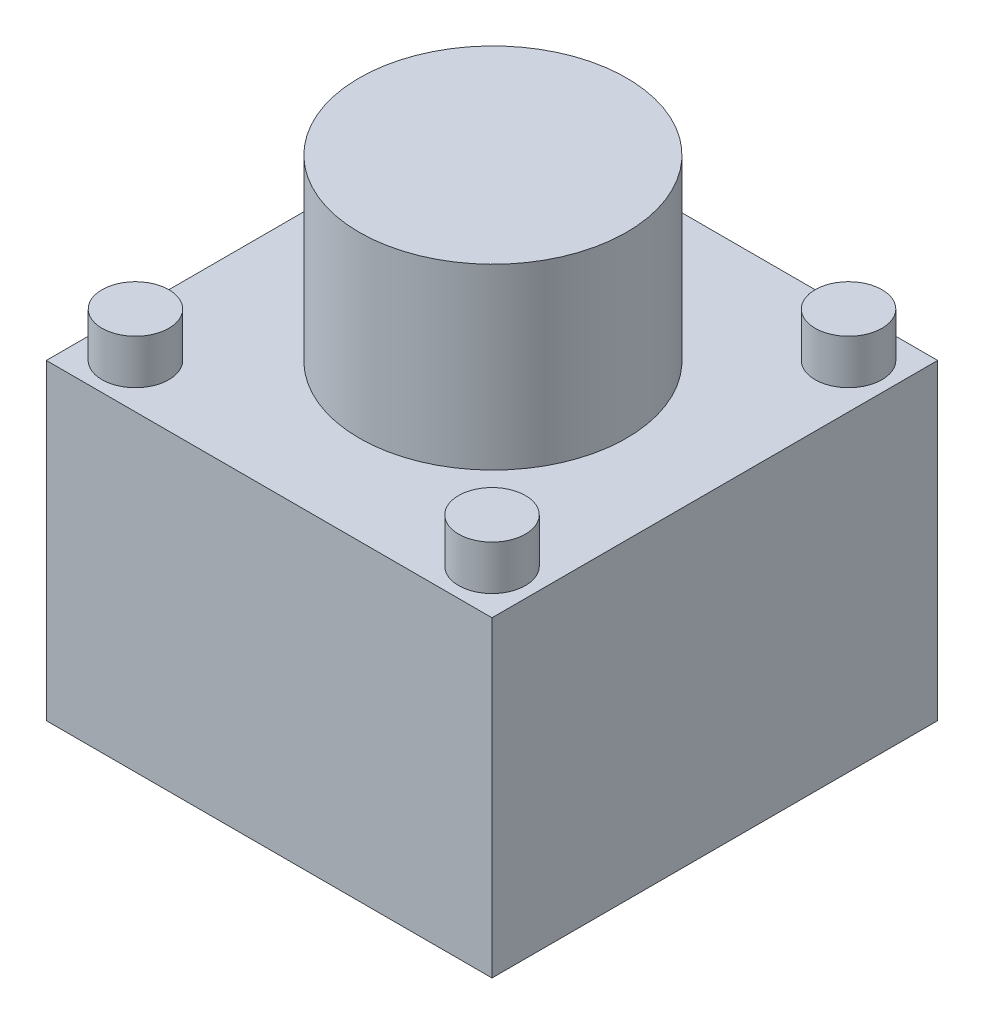
ISO-10303-21;
HEADER;
FILE_DESCRIPTION(('STEP AP214'),'2;1');
FILE_NAME('part.step','',(''),(''),'','','');
FILE_SCHEMA(('AUTOMOTIVE_DESIGN { 1 0 10303 214 1 1 1 1 }'));
ENDSEC;
DATA;
#1=APPLICATION_CONTEXT('core data for automotive mechanical design processes');
#2=APPLICATION_PROTOCOL_DEFINITION('international standard','automotive_design',2000,#1);
#3=PRODUCT_CONTEXT('',#1,'mechanical');
#4=PRODUCT('Part','Part','',(#3));
#5=PRODUCT_RELATED_PRODUCT_CATEGORY('part','',(#4));
#6=PRODUCT_DEFINITION_FORMATION('','',#4);
#7=PRODUCT_DEFINITION_CONTEXT('part definition',#1,'design');
#8=PRODUCT_DEFINITION('design','',#6,#7);
#9=PRODUCT_DEFINITION_SHAPE('','',#8);
#10=(LENGTH_UNIT() NAMED_UNIT(*) SI_UNIT(.MILLI.,.METRE.));
#11=(NAMED_UNIT(*) PLANE_ANGLE_UNIT() SI_UNIT($,.RADIAN.));
#12=(NAMED_UNIT(*) SI_UNIT($,.STERADIAN.) SOLID_ANGLE_UNIT());
#13=UNCERTAINTY_MEASURE_WITH_UNIT(LENGTH_MEASURE(1.E-05),#10,'distance_accuracy_value','');
#14=(GEOMETRIC_REPRESENTATION_CONTEXT(3) GLOBAL_UNCERTAINTY_ASSIGNED_CONTEXT((#13)) GLOBAL_UNIT_ASSIGNED_CONTEXT((#10,
#11,#12)) REPRESENTATION_CONTEXT('',''));
#15=CARTESIAN_POINT('',(0.,0.,0.));
#16=DIRECTION('',(0.,0.,1.));
#17=DIRECTION('',(1.,0.,0.));
#18=AXIS2_PLACEMENT_3D('',#15,#16,#17);
#19=CARTESIAN_POINT('',(0.,7.,0.));
#20=DIRECTION('',(0.,1.,0.));
#21=DIRECTION('',(0.,0.,1.));
#22=AXIS2_PLACEMENT_3D('',#19,#20,#21);
#23=PLANE('',#22);
#24=CARTESIAN_POINT('',(0.891089108910905,7.,-3.56930693069307));
#25=DIRECTION('',(0.,1.,0.));
#26=DIRECTION('',(0.,0.,1.));
#27=AXIS2_PLACEMENT_3D('',#24,#25,#26);
#28=CIRCLE('',#27,0.75);
#29=CARTESIAN_POINT('',(0.891089108910905,7.,-2.81930693069307));
#30=VERTEX_POINT('',#29);
#31=EDGE_CURVE('E130',#30,#30,#28,.T.);
#32=ORIENTED_EDGE('',*,*,#31,.F.);
#33=EDGE_LOOP('',(#32));
#34=FACE_BOUND('',#33,.T.);
#35=CARTESIAN_POINT('',(-7.1089108910891,7.,4.43069306930693));
#36=DIRECTION('',(0.,1.,0.));
#37=DIRECTION('',(0.,0.,1.));
#38=AXIS2_PLACEMENT_3D('',#35,#36,#37);
#39=CIRCLE('',#38,0.750000000000001);
#40=CARTESIAN_POINT('',(-7.1089108910891,7.,5.18069306930694));
#41=VERTEX_POINT('',#40);
#42=EDGE_CURVE('E118',#41,#41,#39,.T.);
#43=ORIENTED_EDGE('',*,*,#42,.F.);
#44=EDGE_LOOP('',(#43));
#45=FACE_BOUND('',#44,.T.);
#46=DIRECTION('',(0.,0.,1.));
#47=VECTOR('',#46,1.);
#48=CARTESIAN_POINT('',(-8.1089108910891,7.,-4.56930693069307));
#49=LINE('',#48,#47);
#50=CARTESIAN_POINT('',(-8.1089108910891,7.,-4.56930693069307));
#51=VERTEX_POINT('',#50);
#52=CARTESIAN_POINT('',(-8.1089108910891,7.,5.43069306930693));
#53=VERTEX_POINT('',#52);
#54=EDGE_CURVE('E86',#51,#53,#49,.T.);
#55=ORIENTED_EDGE('',*,*,#54,.T.);
#56=DIRECTION('',(1.,0.,0.));
#57=VECTOR('',#56,1.);
#58=CARTESIAN_POINT('',(-8.1089108910891,7.,5.43069306930693));
#59=LINE('',#58,#57);
#60=CARTESIAN_POINT('',(1.8910891089109,7.,5.43069306930693));
#61=VERTEX_POINT('',#60);
#62=EDGE_CURVE('E81',#53,#61,#59,.T.);
#63=ORIENTED_EDGE('',*,*,#62,.T.);
#64=DIRECTION('',(0.,0.,-1.));
#65=VECTOR('',#64,1.);
#66=CARTESIAN_POINT('',(1.8910891089109,7.,-4.56930693069307));
#67=LINE('',#66,#65);
#68=CARTESIAN_POINT('',(1.8910891089109,7.,-4.56930693069307));
#69=VERTEX_POINT('',#68);
#70=EDGE_CURVE('E84',#61,#69,#67,.T.);
#71=ORIENTED_EDGE('',*,*,#70,.T.);
#72=DIRECTION('',(-1.,0.,0.));
#73=VECTOR('',#72,1.);
#74=CARTESIAN_POINT('',(-8.1089108910891,7.,-4.56930693069307));
#75=LINE('',#74,#73);
#76=EDGE_CURVE('E51',#69,#51,#75,.T.);
#77=ORIENTED_EDGE('',*,*,#76,.T.);
#78=EDGE_LOOP('',(#55,#63,#71,#77));
#79=FACE_BOUND('',#78,.T.);
#80=CARTESIAN_POINT('',(-7.1089108910891,7.,-3.56930693069307));
#81=DIRECTION('',(0.,1.,0.));
#82=DIRECTION('',(0.,0.,1.));
#83=AXIS2_PLACEMENT_3D('',#80,#81,#82);
#84=CIRCLE('',#83,0.750000000000001);
#85=CARTESIAN_POINT('',(-7.1089108910891,7.,-2.81930693069307));
#86=VERTEX_POINT('',#85);
#87=EDGE_CURVE('E112',#86,#86,#84,.T.);
#88=ORIENTED_EDGE('',*,*,#87,.F.);
#89=EDGE_LOOP('',(#88));
#90=FACE_BOUND('',#89,.T.);
#91=CARTESIAN_POINT('',(0.891089108910905,7.,4.43069306930693));
#92=DIRECTION('',(0.,1.,0.));
#93=DIRECTION('',(0.,0.,1.));
#94=AXIS2_PLACEMENT_3D('',#91,#92,#93);
#95=CIRCLE('',#94,0.75);
#96=CARTESIAN_POINT('',(0.891089108910905,7.,5.18069306930693));
#97=VERTEX_POINT('',#96);
#98=EDGE_CURVE('E124',#97,#97,#95,.T.);
#99=ORIENTED_EDGE('',*,*,#98,.F.);
#100=EDGE_LOOP('',(#99));
#101=FACE_BOUND('',#100,.T.);
#102=CARTESIAN_POINT('',(-3.08862308290808,7.,0.430693069306933));
#103=DIRECTION('',(0.,1.,0.));
#104=DIRECTION('',(0.,0.,1.));
#105=AXIS2_PLACEMENT_3D('',#102,#103,#104);
#106=CIRCLE('',#105,3.);
#107=CARTESIAN_POINT('',(-3.08862308290808,7.,3.43069306930693));
#108=VERTEX_POINT('',#107);
#109=EDGE_CURVE('E136',#108,#108,#106,.T.);
#110=ORIENTED_EDGE('',*,*,#109,.F.);
#111=EDGE_LOOP('',(#110));
#112=FACE_BOUND('',#111,.T.);
#113=ADVANCED_FACE('F34',(#34,#45,#79,#90,#101,#112),#23,.T.);
#114=CARTESIAN_POINT('',(-8.1089108910891,7.,-4.56930693069307));
#115=DIRECTION('',(1.,0.,0.));
#116=DIRECTION('',(0.,0.,-1.));
#117=AXIS2_PLACEMENT_3D('',#114,#115,#116);
#118=PLANE('',#117);
#119=DIRECTION('',(0.,0.,1.));
#120=VECTOR('',#119,1.);
#121=CARTESIAN_POINT('',(-8.1089108910891,0.,-4.56930693069307));
#122=LINE('',#121,#120);
#123=CARTESIAN_POINT('',(-8.1089108910891,0.,-4.56930693069307));
#124=VERTEX_POINT('',#123);
#125=CARTESIAN_POINT('',(-8.1089108910891,0.,5.43069306930693));
#126=VERTEX_POINT('',#125);
#127=EDGE_CURVE('E98',#124,#126,#122,.T.);
#128=ORIENTED_EDGE('',*,*,#127,.T.);
#129=DIRECTION('',(0.,-1.,0.));
#130=VECTOR('',#129,1.);
#131=CARTESIAN_POINT('',(-8.1089108910891,7.,5.43069306930693));
#132=LINE('',#131,#130);
#133=EDGE_CURVE('E11',#53,#126,#132,.T.);
#134=ORIENTED_EDGE('',*,*,#133,.F.);
#135=ORIENTED_EDGE('',*,*,#54,.F.);
#136=DIRECTION('',(0.,-1.,0.));
#137=VECTOR('',#136,1.);
#138=CARTESIAN_POINT('',(-8.1089108910891,7.,-4.56930693069307));
#139=LINE('',#138,#137);
#140=EDGE_CURVE('E94',#51,#124,#139,.T.);
#141=ORIENTED_EDGE('',*,*,#140,.T.);
#142=EDGE_LOOP('',(#128,#134,#135,#141));
#143=FACE_BOUND('',#142,.T.);
#144=ADVANCED_FACE('F36',(#143),#118,.F.);
#145=CARTESIAN_POINT('',(-8.1089108910891,7.,5.43069306930693));
#146=DIRECTION('',(0.,0.,-1.));
#147=DIRECTION('',(-1.,0.,0.));
#148=AXIS2_PLACEMENT_3D('',#145,#146,#147);
#149=PLANE('',#148);
#150=DIRECTION('',(1.,0.,0.));
#151=VECTOR('',#150,1.);
#152=CARTESIAN_POINT('',(-8.1089108910891,0.,5.43069306930693));
#153=LINE('',#152,#151);
#154=CARTESIAN_POINT('',(1.8910891089109,0.,5.43069306930693));
#155=VERTEX_POINT('',#154);
#156=EDGE_CURVE('E90',#126,#155,#153,.T.);
#157=ORIENTED_EDGE('',*,*,#156,.T.);
#158=DIRECTION('',(0.,-1.,0.));
#159=VECTOR('',#158,1.);
#160=CARTESIAN_POINT('',(1.8910891089109,7.,5.43069306930693));
#161=LINE('',#160,#159);
#162=EDGE_CURVE('E43',#61,#155,#161,.T.);
#163=ORIENTED_EDGE('',*,*,#162,.F.);
#164=ORIENTED_EDGE('',*,*,#62,.F.);
#165=ORIENTED_EDGE('',*,*,#133,.T.);
#166=EDGE_LOOP('',(#157,#163,#164,#165));
#167=FACE_BOUND('',#166,.T.);
#168=ADVANCED_FACE('F89',(#167),#149,.F.);
#169=CARTESIAN_POINT('',(1.8910891089109,7.,-4.56930693069307));
#170=DIRECTION('',(-1.,0.,0.));
#171=DIRECTION('',(0.,0.,1.));
#172=AXIS2_PLACEMENT_3D('',#169,#170,#171);
#173=PLANE('',#172);
#174=DIRECTION('',(0.,0.,-1.));
#175=VECTOR('',#174,1.);
#176=CARTESIAN_POINT('',(1.8910891089109,0.,-4.56930693069307));
#177=LINE('',#176,#175);
#178=CARTESIAN_POINT('',(1.8910891089109,0.,-4.56930693069307));
#179=VERTEX_POINT('',#178);
#180=EDGE_CURVE('E68',#155,#179,#177,.T.);
#181=ORIENTED_EDGE('',*,*,#180,.T.);
#182=DIRECTION('',(0.,-1.,0.));
#183=VECTOR('',#182,1.);
#184=CARTESIAN_POINT('',(1.8910891089109,7.,-4.56930693069307));
#185=LINE('',#184,#183);
#186=EDGE_CURVE('E91',#69,#179,#185,.T.);
#187=ORIENTED_EDGE('',*,*,#186,.F.);
#188=ORIENTED_EDGE('',*,*,#70,.F.);
#189=ORIENTED_EDGE('',*,*,#162,.T.);
#190=EDGE_LOOP('',(#181,#187,#188,#189));
#191=FACE_BOUND('',#190,.T.);
#192=ADVANCED_FACE('F92',(#191),#173,.F.);
#193=CARTESIAN_POINT('',(-8.1089108910891,7.,-4.56930693069307));
#194=DIRECTION('',(0.,0.,1.));
#195=DIRECTION('',(1.,0.,0.));
#196=AXIS2_PLACEMENT_3D('',#193,#194,#195);
#197=PLANE('',#196);
#198=DIRECTION('',(-1.,0.,0.));
#199=VECTOR('',#198,1.);
#200=CARTESIAN_POINT('',(-8.1089108910891,0.,-4.56930693069307));
#201=LINE('',#200,#199);
#202=EDGE_CURVE('E74',#179,#124,#201,.T.);
#203=ORIENTED_EDGE('',*,*,#202,.T.);
#204=ORIENTED_EDGE('',*,*,#140,.F.);
#205=ORIENTED_EDGE('',*,*,#76,.F.);
#206=ORIENTED_EDGE('',*,*,#186,.T.);
#207=EDGE_LOOP('',(#203,#204,#205,#206));
#208=FACE_BOUND('',#207,.T.);
#209=ADVANCED_FACE('F106',(#208),#197,.F.);
#210=CARTESIAN_POINT('',(0.,0.,0.));
#211=DIRECTION('',(0.,1.,0.));
#212=DIRECTION('',(0.,0.,1.));
#213=AXIS2_PLACEMENT_3D('',#210,#211,#212);
#214=PLANE('',#213);
#215=ORIENTED_EDGE('',*,*,#127,.F.);
#216=ORIENTED_EDGE('',*,*,#202,.F.);
#217=ORIENTED_EDGE('',*,*,#180,.F.);
#218=ORIENTED_EDGE('',*,*,#156,.F.);
#219=EDGE_LOOP('',(#215,#216,#217,#218));
#220=FACE_BOUND('',#219,.T.);
#221=ADVANCED_FACE('F109',(#220),#214,.F.);
#222=CARTESIAN_POINT('',(-7.1089108910891,8.,-3.56930693069307));
#223=DIRECTION('',(0.,-1.,0.));
#224=DIRECTION('',(0.,0.,-1.));
#225=AXIS2_PLACEMENT_3D('',#222,#223,#224);
#226=CYLINDRICAL_SURFACE('',#225,0.750000000000001);
#227=CARTESIAN_POINT('',(-7.1089108910891,8.,-3.56930693069307));
#228=DIRECTION('',(0.,1.,0.));
#229=DIRECTION('',(0.,0.,1.));
#230=AXIS2_PLACEMENT_3D('',#227,#228,#229);
#231=CIRCLE('',#230,0.750000000000001);
#232=CARTESIAN_POINT('',(-7.1089108910891,8.,-2.81930693069307));
#233=VERTEX_POINT('',#232);
#234=EDGE_CURVE('E101',#233,#233,#231,.T.);
#235=ORIENTED_EDGE('',*,*,#234,.F.);
#236=EDGE_LOOP('',(#235));
#237=FACE_BOUND('',#236,.T.);
#238=ORIENTED_EDGE('',*,*,#87,.T.);
#239=EDGE_LOOP('',(#238));
#240=FACE_BOUND('',#239,.T.);
#241=ADVANCED_FACE('F161',(#237,#240),#226,.T.);
#242=CARTESIAN_POINT('',(-7.1089108910891,8.,-3.56930693069307));
#243=DIRECTION('',(0.,1.,0.));
#244=DIRECTION('',(0.,0.,1.));
#245=AXIS2_PLACEMENT_3D('',#242,#243,#244);
#246=PLANE('',#245);
#247=ORIENTED_EDGE('',*,*,#234,.T.);
#248=EDGE_LOOP('',(#247));
#249=FACE_BOUND('',#248,.T.);
#250=ADVANCED_FACE('F192',(#249),#246,.T.);
#251=CARTESIAN_POINT('',(-7.1089108910891,8.,4.43069306930693));
#252=DIRECTION('',(0.,-1.,0.));
#253=DIRECTION('',(0.,0.,-1.));
#254=AXIS2_PLACEMENT_3D('',#251,#252,#253);
#255=CYLINDRICAL_SURFACE('',#254,0.750000000000001);
#256=CARTESIAN_POINT('',(-7.1089108910891,8.,4.43069306930693));
#257=DIRECTION('',(0.,1.,0.));
#258=DIRECTION('',(0.,0.,1.));
#259=AXIS2_PLACEMENT_3D('',#256,#257,#258);
#260=CIRCLE('',#259,0.750000000000001);
#261=CARTESIAN_POINT('',(-7.1089108910891,8.,5.18069306930694));
#262=VERTEX_POINT('',#261);
#263=EDGE_CURVE('E115',#262,#262,#260,.T.);
#264=ORIENTED_EDGE('',*,*,#263,.F.);
#265=EDGE_LOOP('',(#264));
#266=FACE_BOUND('',#265,.T.);
#267=ORIENTED_EDGE('',*,*,#42,.T.);
#268=EDGE_LOOP('',(#267));
#269=FACE_BOUND('',#268,.T.);
#270=ADVANCED_FACE('F199',(#266,#269),#255,.T.);
#271=CARTESIAN_POINT('',(-7.1089108910891,8.,4.43069306930693));
#272=DIRECTION('',(0.,1.,0.));
#273=DIRECTION('',(0.,0.,1.));
#274=AXIS2_PLACEMENT_3D('',#271,#272,#273);
#275=PLANE('',#274);
#276=ORIENTED_EDGE('',*,*,#263,.T.);
#277=EDGE_LOOP('',(#276));
#278=FACE_BOUND('',#277,.T.);
#279=ADVANCED_FACE('F206',(#278),#275,.T.);
#280=CARTESIAN_POINT('',(0.891089108910905,8.,4.43069306930693));
#281=DIRECTION('',(0.,-1.,0.));
#282=DIRECTION('',(0.,0.,-1.));
#283=AXIS2_PLACEMENT_3D('',#280,#281,#282);
#284=CYLINDRICAL_SURFACE('',#283,0.75);
#285=CARTESIAN_POINT('',(0.891089108910905,8.,4.43069306930693));
#286=DIRECTION('',(0.,1.,0.));
#287=DIRECTION('',(0.,0.,1.));
#288=AXIS2_PLACEMENT_3D('',#285,#286,#287);
#289=CIRCLE('',#288,0.75);
#290=CARTESIAN_POINT('',(0.891089108910905,8.,5.18069306930693));
#291=VERTEX_POINT('',#290);
#292=EDGE_CURVE('E121',#291,#291,#289,.T.);
#293=ORIENTED_EDGE('',*,*,#292,.F.);
#294=EDGE_LOOP('',(#293));
#295=FACE_BOUND('',#294,.T.);
#296=ORIENTED_EDGE('',*,*,#98,.T.);
#297=EDGE_LOOP('',(#296));
#298=FACE_BOUND('',#297,.T.);
#299=ADVANCED_FACE('F214',(#295,#298),#284,.T.);
#300=CARTESIAN_POINT('',(0.891089108910905,8.,4.43069306930693));
#301=DIRECTION('',(0.,1.,0.));
#302=DIRECTION('',(0.,0.,1.));
#303=AXIS2_PLACEMENT_3D('',#300,#301,#302);
#304=PLANE('',#303);
#305=ORIENTED_EDGE('',*,*,#292,.T.);
#306=EDGE_LOOP('',(#305));
#307=FACE_BOUND('',#306,.T.);
#308=ADVANCED_FACE('F222',(#307),#304,.T.);
#309=CARTESIAN_POINT('',(0.891089108910905,8.,-3.56930693069307));
#310=DIRECTION('',(0.,-1.,0.));
#311=DIRECTION('',(0.,0.,-1.));
#312=AXIS2_PLACEMENT_3D('',#309,#310,#311);
#313=CYLINDRICAL_SURFACE('',#312,0.75);
#314=CARTESIAN_POINT('',(0.891089108910905,8.,-3.56930693069307));
#315=DIRECTION('',(0.,1.,0.));
#316=DIRECTION('',(0.,0.,1.));
#317=AXIS2_PLACEMENT_3D('',#314,#315,#316);
#318=CIRCLE('',#317,0.75);
#319=CARTESIAN_POINT('',(0.891089108910905,8.,-2.81930693069307));
#320=VERTEX_POINT('',#319);
#321=EDGE_CURVE('E127',#320,#320,#318,.T.);
#322=ORIENTED_EDGE('',*,*,#321,.F.);
#323=EDGE_LOOP('',(#322));
#324=FACE_BOUND('',#323,.T.);
#325=ORIENTED_EDGE('',*,*,#31,.T.);
#326=EDGE_LOOP('',(#325));
#327=FACE_BOUND('',#326,.T.);
#328=ADVANCED_FACE('F230',(#324,#327),#313,.T.);
#329=CARTESIAN_POINT('',(0.891089108910905,8.,-3.56930693069307));
#330=DIRECTION('',(0.,1.,0.));
#331=DIRECTION('',(0.,0.,1.));
#332=AXIS2_PLACEMENT_3D('',#329,#330,#331);
#333=PLANE('',#332);
#334=ORIENTED_EDGE('',*,*,#321,.T.);
#335=EDGE_LOOP('',(#334));
#336=FACE_BOUND('',#335,.T.);
#337=ADVANCED_FACE('F147',(#336),#333,.T.);
#338=CARTESIAN_POINT('',(-3.08862308290808,11.,0.430693069306933));
#339=DIRECTION('',(0.,-1.,0.));
#340=DIRECTION('',(0.,0.,-1.));
#341=AXIS2_PLACEMENT_3D('',#338,#339,#340);
#342=CYLINDRICAL_SURFACE('',#341,3.);
#343=CARTESIAN_POINT('',(-3.08862308290808,11.,0.430693069306933));
#344=DIRECTION('',(0.,1.,0.));
#345=DIRECTION('',(0.,0.,1.));
#346=AXIS2_PLACEMENT_3D('',#343,#344,#345);
#347=CIRCLE('',#346,3.);
#348=CARTESIAN_POINT('',(-3.08862308290808,11.,3.43069306930693));
#349=VERTEX_POINT('',#348);
#350=EDGE_CURVE('E133',#349,#349,#347,.T.);
#351=ORIENTED_EDGE('',*,*,#350,.F.);
#352=EDGE_LOOP('',(#351));
#353=FACE_BOUND('',#352,.T.);
#354=ORIENTED_EDGE('',*,*,#109,.T.);
#355=EDGE_LOOP('',(#354));
#356=FACE_BOUND('',#355,.T.);
#357=ADVANCED_FACE('F144',(#353,#356),#342,.T.);
#358=CARTESIAN_POINT('',(-3.08862308290808,11.,0.430693069306933));
#359=DIRECTION('',(0.,1.,0.));
#360=DIRECTION('',(0.,0.,1.));
#361=AXIS2_PLACEMENT_3D('',#358,#359,#360);
#362=PLANE('',#361);
#363=ORIENTED_EDGE('',*,*,#350,.T.);
#364=EDGE_LOOP('',(#363));
#365=FACE_BOUND('',#364,.T.);
#366=ADVANCED_FACE('F142',(#365),#362,.T.);
#367=CLOSED_SHELL('',(#113,#144,#168,#192,#209,#221,#241,#250,#270,#279,#299,#308,#328,#337,
#357,#366));
#368=MANIFOLD_SOLID_BREP('B2',#367);
#369=ADVANCED_BREP_SHAPE_REPRESENTATION('',(#18,#368),#14);
#370=SHAPE_DEFINITION_REPRESENTATION(#9,#369);
ENDSEC;
END-ISO-10303-21;
